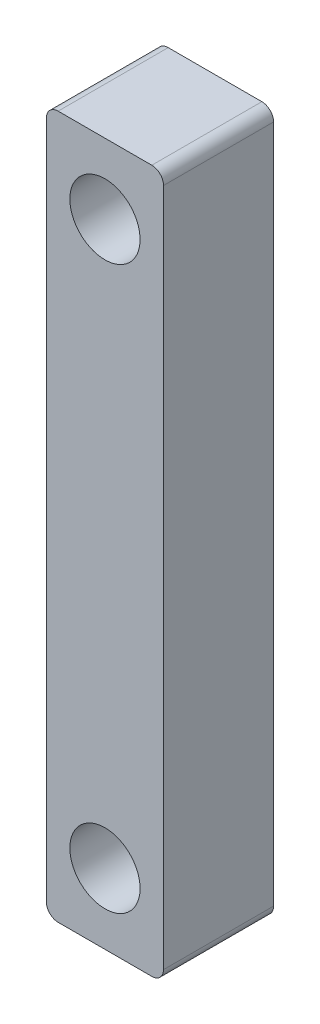
ISO-10303-21;
HEADER;
FILE_DESCRIPTION(('STEP AP214'),'2;1');
FILE_NAME('part.step','',(''),(''),'','','');
FILE_SCHEMA(('AUTOMOTIVE_DESIGN { 1 0 10303 214 1 1 1 1 }'));
ENDSEC;
DATA;
#1=APPLICATION_CONTEXT('core data for automotive mechanical design processes');
#2=APPLICATION_PROTOCOL_DEFINITION('international standard','automotive_design',2000,#1);
#3=PRODUCT_CONTEXT('',#1,'mechanical');
#4=PRODUCT('Part','Part','',(#3));
#5=PRODUCT_RELATED_PRODUCT_CATEGORY('part','',(#4));
#6=PRODUCT_DEFINITION_FORMATION('','',#4);
#7=PRODUCT_DEFINITION_CONTEXT('part definition',#1,'design');
#8=PRODUCT_DEFINITION('design','',#6,#7);
#9=PRODUCT_DEFINITION_SHAPE('','',#8);
#10=(LENGTH_UNIT() NAMED_UNIT(*) SI_UNIT(.MILLI.,.METRE.));
#11=(NAMED_UNIT(*) PLANE_ANGLE_UNIT() SI_UNIT($,.RADIAN.));
#12=(NAMED_UNIT(*) SI_UNIT($,.STERADIAN.) SOLID_ANGLE_UNIT());
#13=UNCERTAINTY_MEASURE_WITH_UNIT(LENGTH_MEASURE(1.E-05),#10,'distance_accuracy_value','');
#14=(GEOMETRIC_REPRESENTATION_CONTEXT(3) GLOBAL_UNCERTAINTY_ASSIGNED_CONTEXT((#13)) GLOBAL_UNIT_ASSIGNED_CONTEXT((#10,
#11,#12)) REPRESENTATION_CONTEXT('',''));
#15=CARTESIAN_POINT('',(0.,0.,0.));
#16=DIRECTION('',(0.,0.,1.));
#17=DIRECTION('',(1.,0.,0.));
#18=AXIS2_PLACEMENT_3D('',#15,#16,#17);
#19=CARTESIAN_POINT('',(4.5,-29.5,4.7));
#20=DIRECTION('',(0.,0.,-1.));
#21=DIRECTION('',(-1.,0.,0.));
#22=AXIS2_PLACEMENT_3D('',#19,#20,#21);
#23=CYLINDRICAL_SURFACE('',#22,0.5);
#24=CARTESIAN_POINT('',(4.5,-29.5,0.));
#25=DIRECTION('',(0.,0.,1.));
#26=DIRECTION('',(-1.,0.,0.));
#27=AXIS2_PLACEMENT_3D('',#24,#25,#26);
#28=CIRCLE('',#27,0.5);
#29=CARTESIAN_POINT('',(4.5,-30.,0.));
#30=VERTEX_POINT('',#29);
#31=CARTESIAN_POINT('',(5.,-29.5,0.));
#32=VERTEX_POINT('',#31);
#33=EDGE_CURVE('E139',#30,#32,#28,.T.);
#34=ORIENTED_EDGE('',*,*,#33,.T.);
#35=DIRECTION('',(0.,0.,-1.));
#36=VECTOR('',#35,1.);
#37=CARTESIAN_POINT('',(5.,-29.5,4.7));
#38=LINE('',#37,#36);
#39=CARTESIAN_POINT('',(5.,-29.5,4.7));
#40=VERTEX_POINT('',#39);
#41=EDGE_CURVE('E11',#40,#32,#38,.T.);
#42=ORIENTED_EDGE('',*,*,#41,.F.);
#43=CARTESIAN_POINT('',(4.5,-29.5,4.7));
#44=DIRECTION('',(0.,0.,1.));
#45=DIRECTION('',(-1.,0.,0.));
#46=AXIS2_PLACEMENT_3D('',#43,#44,#45);
#47=CIRCLE('',#46,0.5);
#48=CARTESIAN_POINT('',(4.5,-30.,4.7));
#49=VERTEX_POINT('',#48);
#50=EDGE_CURVE('E154',#49,#40,#47,.T.);
#51=ORIENTED_EDGE('',*,*,#50,.F.);
#52=DIRECTION('',(0.,0.,-1.));
#53=VECTOR('',#52,1.);
#54=CARTESIAN_POINT('',(4.5,-30.,4.7));
#55=LINE('',#54,#53);
#56=EDGE_CURVE('E135',#49,#30,#55,.T.);
#57=ORIENTED_EDGE('',*,*,#56,.T.);
#58=EDGE_LOOP('',(#34,#42,#51,#57));
#59=FACE_BOUND('',#58,.T.);
#60=ADVANCED_FACE('F43',(#59),#23,.T.);
#61=CARTESIAN_POINT('',(5.,-0.5,4.7));
#62=DIRECTION('',(-1.,0.,0.));
#63=DIRECTION('',(0.,-1.,0.));
#64=AXIS2_PLACEMENT_3D('',#61,#62,#63);
#65=PLANE('',#64);
#66=DIRECTION('',(0.,1.,0.));
#67=VECTOR('',#66,1.);
#68=CARTESIAN_POINT('',(5.,-0.5,0.));
#69=LINE('',#68,#67);
#70=CARTESIAN_POINT('',(5.,-0.5,0.));
#71=VERTEX_POINT('',#70);
#72=EDGE_CURVE('E142',#32,#71,#69,.T.);
#73=ORIENTED_EDGE('',*,*,#72,.T.);
#74=DIRECTION('',(0.,0.,-1.));
#75=VECTOR('',#74,1.);
#76=CARTESIAN_POINT('',(5.,-0.5,4.7));
#77=LINE('',#76,#75);
#78=CARTESIAN_POINT('',(5.,-0.5,4.7));
#79=VERTEX_POINT('',#78);
#80=EDGE_CURVE('E51',#79,#71,#77,.T.);
#81=ORIENTED_EDGE('',*,*,#80,.F.);
#82=DIRECTION('',(0.,1.,0.));
#83=VECTOR('',#82,1.);
#84=CARTESIAN_POINT('',(5.,-0.5,4.7));
#85=LINE('',#84,#83);
#86=EDGE_CURVE('E102',#40,#79,#85,.T.);
#87=ORIENTED_EDGE('',*,*,#86,.F.);
#88=ORIENTED_EDGE('',*,*,#41,.T.);
#89=EDGE_LOOP('',(#73,#81,#87,#88));
#90=FACE_BOUND('',#89,.T.);
#91=ADVANCED_FACE('F223',(#90),#65,.F.);
#92=CARTESIAN_POINT('',(4.5,-0.5,4.7));
#93=DIRECTION('',(0.,0.,-1.));
#94=DIRECTION('',(-1.,0.,0.));
#95=AXIS2_PLACEMENT_3D('',#92,#93,#94);
#96=CYLINDRICAL_SURFACE('',#95,0.5);
#97=CARTESIAN_POINT('',(4.5,-0.5,0.));
#98=DIRECTION('',(0.,0.,1.));
#99=DIRECTION('',(-1.,0.,0.));
#100=AXIS2_PLACEMENT_3D('',#97,#98,#99);
#101=CIRCLE('',#100,0.5);
#102=CARTESIAN_POINT('',(4.5,0.,0.));
#103=VERTEX_POINT('',#102);
#104=EDGE_CURVE('E145',#71,#103,#101,.T.);
#105=ORIENTED_EDGE('',*,*,#104,.T.);
#106=DIRECTION('',(0.,0.,-1.));
#107=VECTOR('',#106,1.);
#108=CARTESIAN_POINT('',(4.5,0.,4.7));
#109=LINE('',#108,#107);
#110=CARTESIAN_POINT('',(4.5,0.,4.7));
#111=VERTEX_POINT('',#110);
#112=EDGE_CURVE('E161',#111,#103,#109,.T.);
#113=ORIENTED_EDGE('',*,*,#112,.F.);
#114=CARTESIAN_POINT('',(4.5,-0.5,4.7));
#115=DIRECTION('',(0.,0.,1.));
#116=DIRECTION('',(-1.,0.,0.));
#117=AXIS2_PLACEMENT_3D('',#114,#115,#116);
#118=CIRCLE('',#117,0.5);
#119=EDGE_CURVE('E169',#79,#111,#118,.T.);
#120=ORIENTED_EDGE('',*,*,#119,.F.);
#121=ORIENTED_EDGE('',*,*,#80,.T.);
#122=EDGE_LOOP('',(#105,#113,#120,#121));
#123=FACE_BOUND('',#122,.T.);
#124=ADVANCED_FACE('F167',(#123),#96,.T.);
#125=CARTESIAN_POINT('',(0.500000000000004,0.,4.7));
#126=DIRECTION('',(0.,-1.,0.));
#127=DIRECTION('',(0.,0.,-1.));
#128=AXIS2_PLACEMENT_3D('',#125,#126,#127);
#129=PLANE('',#128);
#130=DIRECTION('',(-1.,0.,0.));
#131=VECTOR('',#130,1.);
#132=CARTESIAN_POINT('',(0.500000000000004,0.,0.));
#133=LINE('',#132,#131);
#134=CARTESIAN_POINT('',(0.500000000000004,0.,0.));
#135=VERTEX_POINT('',#134);
#136=EDGE_CURVE('E147',#103,#135,#133,.T.);
#137=ORIENTED_EDGE('',*,*,#136,.T.);
#138=DIRECTION('',(0.,0.,-1.));
#139=VECTOR('',#138,1.);
#140=CARTESIAN_POINT('',(0.500000000000004,0.,4.7));
#141=LINE('',#140,#139);
#142=CARTESIAN_POINT('',(0.500000000000004,0.,4.7));
#143=VERTEX_POINT('',#142);
#144=EDGE_CURVE('E158',#143,#135,#141,.T.);
#145=ORIENTED_EDGE('',*,*,#144,.F.);
#146=DIRECTION('',(-1.,0.,0.));
#147=VECTOR('',#146,1.);
#148=CARTESIAN_POINT('',(0.500000000000004,0.,4.7));
#149=LINE('',#148,#147);
#150=EDGE_CURVE('E181',#111,#143,#149,.T.);
#151=ORIENTED_EDGE('',*,*,#150,.F.);
#152=ORIENTED_EDGE('',*,*,#112,.T.);
#153=EDGE_LOOP('',(#137,#145,#151,#152));
#154=FACE_BOUND('',#153,.T.);
#155=ADVANCED_FACE('F177',(#154),#129,.F.);
#156=CARTESIAN_POINT('',(0.5,-0.5,4.7));
#157=DIRECTION('',(0.,0.,-1.));
#158=DIRECTION('',(-1.,0.,0.));
#159=AXIS2_PLACEMENT_3D('',#156,#157,#158);
#160=CYLINDRICAL_SURFACE('',#159,0.5);
#161=CARTESIAN_POINT('',(0.5,-0.5,0.));
#162=DIRECTION('',(0.,0.,1.));
#163=DIRECTION('',(-1.,0.,0.));
#164=AXIS2_PLACEMENT_3D('',#161,#162,#163);
#165=CIRCLE('',#164,0.5);
#166=CARTESIAN_POINT('',(0.,-0.500000000000003,0.));
#167=VERTEX_POINT('',#166);
#168=EDGE_CURVE('E149',#135,#167,#165,.T.);
#169=ORIENTED_EDGE('',*,*,#168,.T.);
#170=DIRECTION('',(0.,0.,-1.));
#171=VECTOR('',#170,1.);
#172=CARTESIAN_POINT('',(0.,-0.500000000000003,4.7));
#173=LINE('',#172,#171);
#174=CARTESIAN_POINT('',(0.,-0.500000000000003,4.7));
#175=VERTEX_POINT('',#174);
#176=EDGE_CURVE('E130',#175,#167,#173,.T.);
#177=ORIENTED_EDGE('',*,*,#176,.F.);
#178=CARTESIAN_POINT('',(0.5,-0.5,4.7));
#179=DIRECTION('',(0.,0.,1.));
#180=DIRECTION('',(-1.,0.,0.));
#181=AXIS2_PLACEMENT_3D('',#178,#179,#180);
#182=CIRCLE('',#181,0.5);
#183=EDGE_CURVE('E121',#143,#175,#182,.T.);
#184=ORIENTED_EDGE('',*,*,#183,.F.);
#185=ORIENTED_EDGE('',*,*,#144,.T.);
#186=EDGE_LOOP('',(#169,#177,#184,#185));
#187=FACE_BOUND('',#186,.T.);
#188=ADVANCED_FACE('F180',(#187),#160,.T.);
#189=CARTESIAN_POINT('',(0.,-0.500000000000004,4.7));
#190=DIRECTION('',(1.,0.,0.));
#191=DIRECTION('',(0.,1.,0.));
#192=AXIS2_PLACEMENT_3D('',#189,#190,#191);
#193=PLANE('',#192);
#194=DIRECTION('',(0.,-1.,0.));
#195=VECTOR('',#194,1.);
#196=CARTESIAN_POINT('',(0.,-0.500000000000004,0.));
#197=LINE('',#196,#195);
#198=CARTESIAN_POINT('',(0.,-29.5,0.));
#199=VERTEX_POINT('',#198);
#200=EDGE_CURVE('E129',#167,#199,#197,.T.);
#201=ORIENTED_EDGE('',*,*,#200,.T.);
#202=DIRECTION('',(0.,0.,-1.));
#203=VECTOR('',#202,1.);
#204=CARTESIAN_POINT('',(0.,-29.5,4.7));
#205=LINE('',#204,#203);
#206=CARTESIAN_POINT('',(0.,-29.5,4.7));
#207=VERTEX_POINT('',#206);
#208=EDGE_CURVE('E126',#207,#199,#205,.T.);
#209=ORIENTED_EDGE('',*,*,#208,.F.);
#210=DIRECTION('',(0.,-1.,0.));
#211=VECTOR('',#210,1.);
#212=CARTESIAN_POINT('',(0.,-0.500000000000004,4.7));
#213=LINE('',#212,#211);
#214=EDGE_CURVE('E115',#175,#207,#213,.T.);
#215=ORIENTED_EDGE('',*,*,#214,.F.);
#216=ORIENTED_EDGE('',*,*,#176,.T.);
#217=EDGE_LOOP('',(#201,#209,#215,#216));
#218=FACE_BOUND('',#217,.T.);
#219=ADVANCED_FACE('F127',(#218),#193,.F.);
#220=CARTESIAN_POINT('',(0.500000000000002,-29.5,4.7));
#221=DIRECTION('',(0.,0.,-1.));
#222=DIRECTION('',(-1.,0.,0.));
#223=AXIS2_PLACEMENT_3D('',#220,#221,#222);
#224=CYLINDRICAL_SURFACE('',#223,0.5);
#225=CARTESIAN_POINT('',(0.500000000000002,-29.5,0.));
#226=DIRECTION('',(0.,0.,1.));
#227=DIRECTION('',(1.,0.,0.));
#228=AXIS2_PLACEMENT_3D('',#225,#226,#227);
#229=CIRCLE('',#228,0.5);
#230=CARTESIAN_POINT('',(0.500000000000002,-30.,0.));
#231=VERTEX_POINT('',#230);
#232=EDGE_CURVE('E88',#199,#231,#229,.T.);
#233=ORIENTED_EDGE('',*,*,#232,.T.);
#234=DIRECTION('',(0.,0.,-1.));
#235=VECTOR('',#234,1.);
#236=CARTESIAN_POINT('',(0.500000000000002,-30.,4.7));
#237=LINE('',#236,#235);
#238=CARTESIAN_POINT('',(0.500000000000002,-30.,4.7));
#239=VERTEX_POINT('',#238);
#240=EDGE_CURVE('E131',#239,#231,#237,.T.);
#241=ORIENTED_EDGE('',*,*,#240,.F.);
#242=CARTESIAN_POINT('',(0.500000000000002,-29.5,4.7));
#243=DIRECTION('',(0.,0.,1.));
#244=DIRECTION('',(1.,0.,0.));
#245=AXIS2_PLACEMENT_3D('',#242,#243,#244);
#246=CIRCLE('',#245,0.5);
#247=EDGE_CURVE('E119',#207,#239,#246,.T.);
#248=ORIENTED_EDGE('',*,*,#247,.F.);
#249=ORIENTED_EDGE('',*,*,#208,.T.);
#250=EDGE_LOOP('',(#233,#241,#248,#249));
#251=FACE_BOUND('',#250,.T.);
#252=ADVANCED_FACE('F133',(#251),#224,.T.);
#253=CARTESIAN_POINT('',(0.500000000000002,-30.,4.7));
#254=DIRECTION('',(0.,1.,0.));
#255=DIRECTION('',(0.,0.,1.));
#256=AXIS2_PLACEMENT_3D('',#253,#254,#255);
#257=PLANE('',#256);
#258=DIRECTION('',(1.,0.,0.));
#259=VECTOR('',#258,1.);
#260=CARTESIAN_POINT('',(0.500000000000002,-30.,0.));
#261=LINE('',#260,#259);
#262=EDGE_CURVE('E94',#231,#30,#261,.T.);
#263=ORIENTED_EDGE('',*,*,#262,.T.);
#264=ORIENTED_EDGE('',*,*,#56,.F.);
#265=DIRECTION('',(1.,0.,0.));
#266=VECTOR('',#265,1.);
#267=CARTESIAN_POINT('',(0.500000000000002,-30.,4.7));
#268=LINE('',#267,#266);
#269=EDGE_CURVE('E59',#239,#49,#268,.T.);
#270=ORIENTED_EDGE('',*,*,#269,.F.);
#271=ORIENTED_EDGE('',*,*,#240,.T.);
#272=EDGE_LOOP('',(#263,#264,#270,#271));
#273=FACE_BOUND('',#272,.T.);
#274=ADVANCED_FACE('F210',(#273),#257,.F.);
#275=CARTESIAN_POINT('',(4.5,-29.5,4.7));
#276=DIRECTION('',(0.,0.,-1.));
#277=DIRECTION('',(-1.,0.,0.));
#278=AXIS2_PLACEMENT_3D('',#275,#276,#277);
#279=PLANE('',#278);
#280=CARTESIAN_POINT('',(2.5,-27.,4.7));
#281=DIRECTION('',(0.,0.,1.));
#282=DIRECTION('',(1.,0.,0.));
#283=AXIS2_PLACEMENT_3D('',#280,#281,#282);
#284=CIRCLE('',#283,1.5);
#285=CARTESIAN_POINT('',(4.,-27.,4.7));
#286=VERTEX_POINT('',#285);
#287=EDGE_CURVE('E193',#286,#286,#284,.T.);
#288=ORIENTED_EDGE('',*,*,#287,.F.);
#289=EDGE_LOOP('',(#288));
#290=FACE_BOUND('',#289,.T.);
#291=CARTESIAN_POINT('',(2.5,-3.,4.7));
#292=DIRECTION('',(0.,0.,1.));
#293=DIRECTION('',(-1.,0.,0.));
#294=AXIS2_PLACEMENT_3D('',#291,#292,#293);
#295=CIRCLE('',#294,1.5);
#296=CARTESIAN_POINT('',(1.,-3.,4.7));
#297=VERTEX_POINT('',#296);
#298=EDGE_CURVE('E190',#297,#297,#295,.T.);
#299=ORIENTED_EDGE('',*,*,#298,.F.);
#300=EDGE_LOOP('',(#299));
#301=FACE_BOUND('',#300,.T.);
#302=ORIENTED_EDGE('',*,*,#50,.T.);
#303=ORIENTED_EDGE('',*,*,#86,.T.);
#304=ORIENTED_EDGE('',*,*,#119,.T.);
#305=ORIENTED_EDGE('',*,*,#150,.T.);
#306=ORIENTED_EDGE('',*,*,#183,.T.);
#307=ORIENTED_EDGE('',*,*,#214,.T.);
#308=ORIENTED_EDGE('',*,*,#247,.T.);
#309=ORIENTED_EDGE('',*,*,#269,.T.);
#310=EDGE_LOOP('',(#302,#303,#304,#305,#306,#307,#308,#309));
#311=FACE_BOUND('',#310,.T.);
#312=ADVANCED_FACE('F117',(#290,#301,#311),#279,.F.);
#313=CARTESIAN_POINT('',(4.5,-29.5,0.));
#314=DIRECTION('',(0.,0.,-1.));
#315=DIRECTION('',(-1.,0.,0.));
#316=AXIS2_PLACEMENT_3D('',#313,#314,#315);
#317=PLANE('',#316);
#318=CARTESIAN_POINT('',(2.5,-27.,0.));
#319=DIRECTION('',(0.,0.,1.));
#320=DIRECTION('',(1.,0.,0.));
#321=AXIS2_PLACEMENT_3D('',#318,#319,#320);
#322=CIRCLE('',#321,1.5);
#323=CARTESIAN_POINT('',(4.,-27.,0.));
#324=VERTEX_POINT('',#323);
#325=EDGE_CURVE('E143',#324,#324,#322,.T.);
#326=ORIENTED_EDGE('',*,*,#325,.T.);
#327=EDGE_LOOP('',(#326));
#328=FACE_BOUND('',#327,.T.);
#329=CARTESIAN_POINT('',(2.5,-3.,0.));
#330=DIRECTION('',(0.,0.,1.));
#331=DIRECTION('',(-1.,0.,0.));
#332=AXIS2_PLACEMENT_3D('',#329,#330,#331);
#333=CIRCLE('',#332,1.5);
#334=CARTESIAN_POINT('',(1.,-3.,0.));
#335=VERTEX_POINT('',#334);
#336=EDGE_CURVE('E187',#335,#335,#333,.T.);
#337=ORIENTED_EDGE('',*,*,#336,.T.);
#338=EDGE_LOOP('',(#337));
#339=FACE_BOUND('',#338,.T.);
#340=ORIENTED_EDGE('',*,*,#33,.F.);
#341=ORIENTED_EDGE('',*,*,#262,.F.);
#342=ORIENTED_EDGE('',*,*,#232,.F.);
#343=ORIENTED_EDGE('',*,*,#200,.F.);
#344=ORIENTED_EDGE('',*,*,#168,.F.);
#345=ORIENTED_EDGE('',*,*,#136,.F.);
#346=ORIENTED_EDGE('',*,*,#104,.F.);
#347=ORIENTED_EDGE('',*,*,#72,.F.);
#348=EDGE_LOOP('',(#340,#341,#342,#343,#344,#345,#346,#347));
#349=FACE_BOUND('',#348,.T.);
#350=ADVANCED_FACE('F173',(#328,#339,#349),#317,.T.);
#351=CARTESIAN_POINT('',(2.5,-3.,0.));
#352=DIRECTION('',(0.,0.,1.));
#353=DIRECTION('',(1.,0.,0.));
#354=AXIS2_PLACEMENT_3D('',#351,#352,#353);
#355=CYLINDRICAL_SURFACE('',#354,1.5);
#356=ORIENTED_EDGE('',*,*,#336,.F.);
#357=EDGE_LOOP('',(#356));
#358=FACE_BOUND('',#357,.T.);
#359=ORIENTED_EDGE('',*,*,#298,.T.);
#360=EDGE_LOOP('',(#359));
#361=FACE_BOUND('',#360,.T.);
#362=ADVANCED_FACE('F204',(#358,#361),#355,.F.);
#363=CARTESIAN_POINT('',(2.5,-27.,0.));
#364=DIRECTION('',(0.,0.,1.));
#365=DIRECTION('',(1.,0.,0.));
#366=AXIS2_PLACEMENT_3D('',#363,#364,#365);
#367=CYLINDRICAL_SURFACE('',#366,1.5);
#368=ORIENTED_EDGE('',*,*,#325,.F.);
#369=EDGE_LOOP('',(#368));
#370=FACE_BOUND('',#369,.T.);
#371=ORIENTED_EDGE('',*,*,#287,.T.);
#372=EDGE_LOOP('',(#371));
#373=FACE_BOUND('',#372,.T.);
#374=ADVANCED_FACE('F201',(#370,#373),#367,.F.);
#375=CLOSED_SHELL('',(#60,#91,#124,#155,#188,#219,#252,#274,#312,#350,#362,#374));
#376=MANIFOLD_SOLID_BREP('B2',#375);
#377=ADVANCED_BREP_SHAPE_REPRESENTATION('',(#18,#376),#14);
#378=SHAPE_DEFINITION_REPRESENTATION(#9,#377);
ENDSEC;
END-ISO-10303-21;
